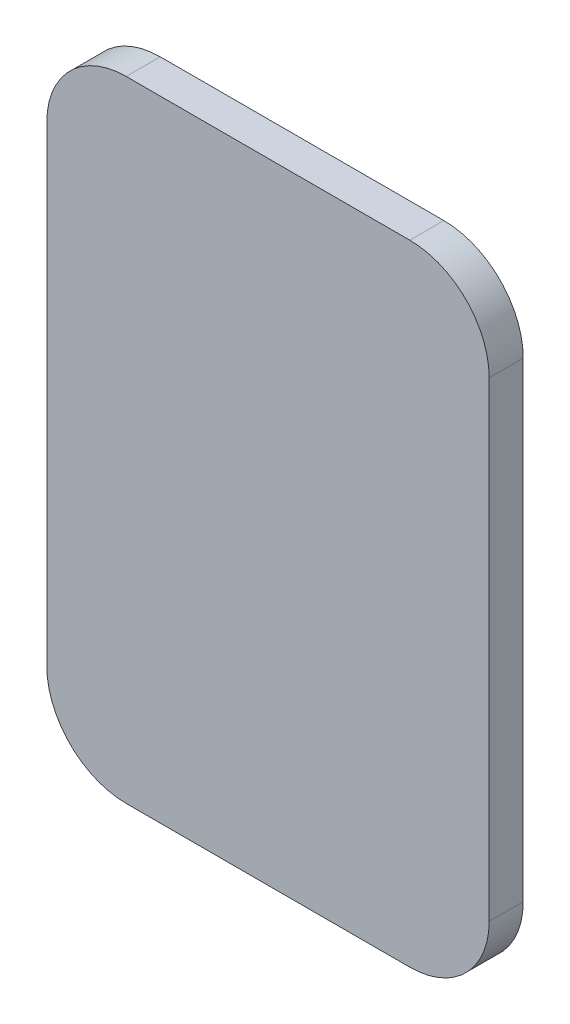
ISO-10303-21;
HEADER;
FILE_DESCRIPTION(('STEP AP214'),'2;1');
FILE_NAME('part.step','',(''),(''),'','','');
FILE_SCHEMA(('AUTOMOTIVE_DESIGN { 1 0 10303 214 1 1 1 1 }'));
ENDSEC;
DATA;
#1=APPLICATION_CONTEXT('core data for automotive mechanical design processes');
#2=APPLICATION_PROTOCOL_DEFINITION('international standard','automotive_design',2000,#1);
#3=PRODUCT_CONTEXT('',#1,'mechanical');
#4=PRODUCT('Part','Part','',(#3));
#5=PRODUCT_RELATED_PRODUCT_CATEGORY('part','',(#4));
#6=PRODUCT_DEFINITION_FORMATION('','',#4);
#7=PRODUCT_DEFINITION_CONTEXT('part definition',#1,'design');
#8=PRODUCT_DEFINITION('design','',#6,#7);
#9=PRODUCT_DEFINITION_SHAPE('','',#8);
#10=(LENGTH_UNIT() NAMED_UNIT(*) SI_UNIT(.MILLI.,.METRE.));
#11=(NAMED_UNIT(*) PLANE_ANGLE_UNIT() SI_UNIT($,.RADIAN.));
#12=(NAMED_UNIT(*) SI_UNIT($,.STERADIAN.) SOLID_ANGLE_UNIT());
#13=UNCERTAINTY_MEASURE_WITH_UNIT(LENGTH_MEASURE(1.E-05),#10,'distance_accuracy_value','');
#14=(GEOMETRIC_REPRESENTATION_CONTEXT(3) GLOBAL_UNCERTAINTY_ASSIGNED_CONTEXT((#13)) GLOBAL_UNIT_ASSIGNED_CONTEXT((#10,
#11,#12)) REPRESENTATION_CONTEXT('',''));
#15=CARTESIAN_POINT('',(0.,0.,0.));
#16=DIRECTION('',(0.,0.,1.));
#17=DIRECTION('',(1.,0.,0.));
#18=AXIS2_PLACEMENT_3D('',#15,#16,#17);
#19=CARTESIAN_POINT('',(-25.,41.5,6.));
#20=DIRECTION('',(0.,0.,-1.));
#21=DIRECTION('',(-1.,0.,0.));
#22=AXIS2_PLACEMENT_3D('',#19,#20,#21);
#23=CYLINDRICAL_SURFACE('',#22,14.);
#24=CARTESIAN_POINT('',(-25.,41.5,0.));
#25=DIRECTION('',(0.,0.,1.));
#26=DIRECTION('',(-1.,0.,0.));
#27=AXIS2_PLACEMENT_3D('',#24,#25,#26);
#28=CIRCLE('',#27,14.);
#29=CARTESIAN_POINT('',(-25.,55.5,0.));
#30=VERTEX_POINT('',#29);
#31=CARTESIAN_POINT('',(-39.,41.5,0.));
#32=VERTEX_POINT('',#31);
#33=EDGE_CURVE('E131',#30,#32,#28,.T.);
#34=ORIENTED_EDGE('',*,*,#33,.T.);
#35=DIRECTION('',(0.,0.,-1.));
#36=VECTOR('',#35,1.);
#37=CARTESIAN_POINT('',(-39.,41.5,6.));
#38=LINE('',#37,#36);
#39=CARTESIAN_POINT('',(-39.,41.5,6.));
#40=VERTEX_POINT('',#39);
#41=EDGE_CURVE('E11',#40,#32,#38,.T.);
#42=ORIENTED_EDGE('',*,*,#41,.F.);
#43=CARTESIAN_POINT('',(-25.,41.5,6.));
#44=DIRECTION('',(0.,0.,1.));
#45=DIRECTION('',(-1.,0.,0.));
#46=AXIS2_PLACEMENT_3D('',#43,#44,#45);
#47=CIRCLE('',#46,14.);
#48=CARTESIAN_POINT('',(-25.,55.5,6.));
#49=VERTEX_POINT('',#48);
#50=EDGE_CURVE('E145',#49,#40,#47,.T.);
#51=ORIENTED_EDGE('',*,*,#50,.F.);
#52=DIRECTION('',(0.,0.,-1.));
#53=VECTOR('',#52,1.);
#54=CARTESIAN_POINT('',(-25.,55.5,6.));
#55=LINE('',#54,#53);
#56=EDGE_CURVE('E127',#49,#30,#55,.T.);
#57=ORIENTED_EDGE('',*,*,#56,.T.);
#58=EDGE_LOOP('',(#34,#42,#51,#57));
#59=FACE_BOUND('',#58,.T.);
#60=ADVANCED_FACE('F35',(#59),#23,.T.);
#61=CARTESIAN_POINT('',(-39.,-41.5,6.));
#62=DIRECTION('',(1.,0.,0.));
#63=DIRECTION('',(0.,0.,-1.));
#64=AXIS2_PLACEMENT_3D('',#61,#62,#63);
#65=PLANE('',#64);
#66=DIRECTION('',(0.,-1.,0.));
#67=VECTOR('',#66,1.);
#68=CARTESIAN_POINT('',(-39.,-41.5,0.));
#69=LINE('',#68,#67);
#70=CARTESIAN_POINT('',(-39.,-41.5,0.));
#71=VERTEX_POINT('',#70);
#72=EDGE_CURVE('E134',#32,#71,#69,.T.);
#73=ORIENTED_EDGE('',*,*,#72,.T.);
#74=DIRECTION('',(0.,0.,-1.));
#75=VECTOR('',#74,1.);
#76=CARTESIAN_POINT('',(-39.,-41.5,6.));
#77=LINE('',#76,#75);
#78=CARTESIAN_POINT('',(-39.,-41.5,6.));
#79=VERTEX_POINT('',#78);
#80=EDGE_CURVE('E43',#79,#71,#77,.T.);
#81=ORIENTED_EDGE('',*,*,#80,.F.);
#82=DIRECTION('',(0.,-1.,0.));
#83=VECTOR('',#82,1.);
#84=CARTESIAN_POINT('',(-39.,-41.5,6.));
#85=LINE('',#84,#83);
#86=EDGE_CURVE('E94',#40,#79,#85,.T.);
#87=ORIENTED_EDGE('',*,*,#86,.F.);
#88=ORIENTED_EDGE('',*,*,#41,.T.);
#89=EDGE_LOOP('',(#73,#81,#87,#88));
#90=FACE_BOUND('',#89,.T.);
#91=ADVANCED_FACE('F180',(#90),#65,.F.);
#92=CARTESIAN_POINT('',(-25.,-41.5,6.));
#93=DIRECTION('',(0.,0.,-1.));
#94=DIRECTION('',(-1.,0.,0.));
#95=AXIS2_PLACEMENT_3D('',#92,#93,#94);
#96=CYLINDRICAL_SURFACE('',#95,14.);
#97=CARTESIAN_POINT('',(-25.,-41.5,0.));
#98=DIRECTION('',(0.,0.,1.));
#99=DIRECTION('',(-1.,0.,0.));
#100=AXIS2_PLACEMENT_3D('',#97,#98,#99);
#101=CIRCLE('',#100,14.);
#102=CARTESIAN_POINT('',(-25.,-55.5,0.));
#103=VERTEX_POINT('',#102);
#104=EDGE_CURVE('E136',#71,#103,#101,.T.);
#105=ORIENTED_EDGE('',*,*,#104,.T.);
#106=DIRECTION('',(0.,0.,-1.));
#107=VECTOR('',#106,1.);
#108=CARTESIAN_POINT('',(-25.,-55.5,6.));
#109=LINE('',#108,#107);
#110=CARTESIAN_POINT('',(-25.,-55.5,6.));
#111=VERTEX_POINT('',#110);
#112=EDGE_CURVE('E152',#111,#103,#109,.T.);
#113=ORIENTED_EDGE('',*,*,#112,.F.);
#114=CARTESIAN_POINT('',(-25.,-41.5,6.));
#115=DIRECTION('',(0.,0.,1.));
#116=DIRECTION('',(-1.,0.,0.));
#117=AXIS2_PLACEMENT_3D('',#114,#115,#116);
#118=CIRCLE('',#117,14.);
#119=EDGE_CURVE('E160',#79,#111,#118,.T.);
#120=ORIENTED_EDGE('',*,*,#119,.F.);
#121=ORIENTED_EDGE('',*,*,#80,.T.);
#122=EDGE_LOOP('',(#105,#113,#120,#121));
#123=FACE_BOUND('',#122,.T.);
#124=ADVANCED_FACE('F158',(#123),#96,.T.);
#125=CARTESIAN_POINT('',(25.,-55.5,6.));
#126=DIRECTION('',(0.,1.,0.));
#127=DIRECTION('',(0.,0.,1.));
#128=AXIS2_PLACEMENT_3D('',#125,#126,#127);
#129=PLANE('',#128);
#130=DIRECTION('',(1.,0.,0.));
#131=VECTOR('',#130,1.);
#132=CARTESIAN_POINT('',(25.,-55.5,0.));
#133=LINE('',#132,#131);
#134=CARTESIAN_POINT('',(25.,-55.5,0.));
#135=VERTEX_POINT('',#134);
#136=EDGE_CURVE('E138',#103,#135,#133,.T.);
#137=ORIENTED_EDGE('',*,*,#136,.T.);
#138=DIRECTION('',(0.,0.,-1.));
#139=VECTOR('',#138,1.);
#140=CARTESIAN_POINT('',(25.,-55.5,6.));
#141=LINE('',#140,#139);
#142=CARTESIAN_POINT('',(25.,-55.5,6.));
#143=VERTEX_POINT('',#142);
#144=EDGE_CURVE('E149',#143,#135,#141,.T.);
#145=ORIENTED_EDGE('',*,*,#144,.F.);
#146=DIRECTION('',(1.,0.,0.));
#147=VECTOR('',#146,1.);
#148=CARTESIAN_POINT('',(25.,-55.5,6.));
#149=LINE('',#148,#147);
#150=EDGE_CURVE('E172',#111,#143,#149,.T.);
#151=ORIENTED_EDGE('',*,*,#150,.F.);
#152=ORIENTED_EDGE('',*,*,#112,.T.);
#153=EDGE_LOOP('',(#137,#145,#151,#152));
#154=FACE_BOUND('',#153,.T.);
#155=ADVANCED_FACE('F168',(#154),#129,.F.);
#156=CARTESIAN_POINT('',(24.9999999999999,-41.5,6.));
#157=DIRECTION('',(0.,0.,-1.));
#158=DIRECTION('',(-1.,0.,0.));
#159=AXIS2_PLACEMENT_3D('',#156,#157,#158);
#160=CYLINDRICAL_SURFACE('',#159,14.);
#161=CARTESIAN_POINT('',(24.9999999999999,-41.5,0.));
#162=DIRECTION('',(0.,0.,1.));
#163=DIRECTION('',(-1.,0.,0.));
#164=AXIS2_PLACEMENT_3D('',#161,#162,#163);
#165=CIRCLE('',#164,14.);
#166=CARTESIAN_POINT('',(39.,-41.5,0.));
#167=VERTEX_POINT('',#166);
#168=EDGE_CURVE('E140',#135,#167,#165,.T.);
#169=ORIENTED_EDGE('',*,*,#168,.T.);
#170=DIRECTION('',(0.,0.,-1.));
#171=VECTOR('',#170,1.);
#172=CARTESIAN_POINT('',(39.,-41.5,6.));
#173=LINE('',#172,#171);
#174=CARTESIAN_POINT('',(39.,-41.5,6.));
#175=VERTEX_POINT('',#174);
#176=EDGE_CURVE('E122',#175,#167,#173,.T.);
#177=ORIENTED_EDGE('',*,*,#176,.F.);
#178=CARTESIAN_POINT('',(24.9999999999999,-41.5,6.));
#179=DIRECTION('',(0.,0.,1.));
#180=DIRECTION('',(-1.,0.,0.));
#181=AXIS2_PLACEMENT_3D('',#178,#179,#180);
#182=CIRCLE('',#181,14.);
#183=EDGE_CURVE('E113',#143,#175,#182,.T.);
#184=ORIENTED_EDGE('',*,*,#183,.F.);
#185=ORIENTED_EDGE('',*,*,#144,.T.);
#186=EDGE_LOOP('',(#169,#177,#184,#185));
#187=FACE_BOUND('',#186,.T.);
#188=ADVANCED_FACE('F171',(#187),#160,.T.);
#189=CARTESIAN_POINT('',(39.,41.5,6.));
#190=DIRECTION('',(-1.,0.,0.));
#191=DIRECTION('',(0.,0.,1.));
#192=AXIS2_PLACEMENT_3D('',#189,#190,#191);
#193=PLANE('',#192);
#194=DIRECTION('',(0.,1.,0.));
#195=VECTOR('',#194,1.);
#196=CARTESIAN_POINT('',(39.,41.5,0.));
#197=LINE('',#196,#195);
#198=CARTESIAN_POINT('',(39.,41.5,0.));
#199=VERTEX_POINT('',#198);
#200=EDGE_CURVE('E121',#167,#199,#197,.T.);
#201=ORIENTED_EDGE('',*,*,#200,.T.);
#202=DIRECTION('',(0.,0.,-1.));
#203=VECTOR('',#202,1.);
#204=CARTESIAN_POINT('',(39.,41.5,6.));
#205=LINE('',#204,#203);
#206=CARTESIAN_POINT('',(39.,41.5,6.));
#207=VERTEX_POINT('',#206);
#208=EDGE_CURVE('E118',#207,#199,#205,.T.);
#209=ORIENTED_EDGE('',*,*,#208,.F.);
#210=DIRECTION('',(0.,1.,0.));
#211=VECTOR('',#210,1.);
#212=CARTESIAN_POINT('',(39.,41.5,6.));
#213=LINE('',#212,#211);
#214=EDGE_CURVE('E107',#175,#207,#213,.T.);
#215=ORIENTED_EDGE('',*,*,#214,.F.);
#216=ORIENTED_EDGE('',*,*,#176,.T.);
#217=EDGE_LOOP('',(#201,#209,#215,#216));
#218=FACE_BOUND('',#217,.T.);
#219=ADVANCED_FACE('F119',(#218),#193,.F.);
#220=CARTESIAN_POINT('',(25.,41.5,6.));
#221=DIRECTION('',(0.,0.,-1.));
#222=DIRECTION('',(-1.,0.,0.));
#223=AXIS2_PLACEMENT_3D('',#220,#221,#222);
#224=CYLINDRICAL_SURFACE('',#223,14.);
#225=CARTESIAN_POINT('',(25.,41.5,0.));
#226=DIRECTION('',(0.,0.,1.));
#227=DIRECTION('',(-1.,0.,0.));
#228=AXIS2_PLACEMENT_3D('',#225,#226,#227);
#229=CIRCLE('',#228,14.);
#230=CARTESIAN_POINT('',(25.,55.5,0.));
#231=VERTEX_POINT('',#230);
#232=EDGE_CURVE('E80',#199,#231,#229,.T.);
#233=ORIENTED_EDGE('',*,*,#232,.T.);
#234=DIRECTION('',(0.,0.,-1.));
#235=VECTOR('',#234,1.);
#236=CARTESIAN_POINT('',(25.,55.5,6.));
#237=LINE('',#236,#235);
#238=CARTESIAN_POINT('',(25.,55.5,6.));
#239=VERTEX_POINT('',#238);
#240=EDGE_CURVE('E123',#239,#231,#237,.T.);
#241=ORIENTED_EDGE('',*,*,#240,.F.);
#242=CARTESIAN_POINT('',(25.,41.5,6.));
#243=DIRECTION('',(0.,0.,1.));
#244=DIRECTION('',(-1.,0.,0.));
#245=AXIS2_PLACEMENT_3D('',#242,#243,#244);
#246=CIRCLE('',#245,14.);
#247=EDGE_CURVE('E111',#207,#239,#246,.T.);
#248=ORIENTED_EDGE('',*,*,#247,.F.);
#249=ORIENTED_EDGE('',*,*,#208,.T.);
#250=EDGE_LOOP('',(#233,#241,#248,#249));
#251=FACE_BOUND('',#250,.T.);
#252=ADVANCED_FACE('F125',(#251),#224,.T.);
#253=CARTESIAN_POINT('',(-25.,55.5,6.));
#254=DIRECTION('',(0.,-1.,0.));
#255=DIRECTION('',(0.,0.,-1.));
#256=AXIS2_PLACEMENT_3D('',#253,#254,#255);
#257=PLANE('',#256);
#258=DIRECTION('',(-1.,0.,0.));
#259=VECTOR('',#258,1.);
#260=CARTESIAN_POINT('',(-25.,55.5,0.));
#261=LINE('',#260,#259);
#262=EDGE_CURVE('E86',#231,#30,#261,.T.);
#263=ORIENTED_EDGE('',*,*,#262,.T.);
#264=ORIENTED_EDGE('',*,*,#56,.F.);
#265=DIRECTION('',(-1.,0.,0.));
#266=VECTOR('',#265,1.);
#267=CARTESIAN_POINT('',(-25.,55.5,6.));
#268=LINE('',#267,#266);
#269=EDGE_CURVE('E51',#239,#49,#268,.T.);
#270=ORIENTED_EDGE('',*,*,#269,.F.);
#271=ORIENTED_EDGE('',*,*,#240,.T.);
#272=EDGE_LOOP('',(#263,#264,#270,#271));
#273=FACE_BOUND('',#272,.T.);
#274=ADVANCED_FACE('F196',(#273),#257,.F.);
#275=CARTESIAN_POINT('',(-25.,41.5,6.));
#276=DIRECTION('',(0.,0.,-1.));
#277=DIRECTION('',(-1.,0.,0.));
#278=AXIS2_PLACEMENT_3D('',#275,#276,#277);
#279=PLANE('',#278);
#280=ORIENTED_EDGE('',*,*,#50,.T.);
#281=ORIENTED_EDGE('',*,*,#86,.T.);
#282=ORIENTED_EDGE('',*,*,#119,.T.);
#283=ORIENTED_EDGE('',*,*,#150,.T.);
#284=ORIENTED_EDGE('',*,*,#183,.T.);
#285=ORIENTED_EDGE('',*,*,#214,.T.);
#286=ORIENTED_EDGE('',*,*,#247,.T.);
#287=ORIENTED_EDGE('',*,*,#269,.T.);
#288=EDGE_LOOP('',(#280,#281,#282,#283,#284,#285,#286,#287));
#289=FACE_BOUND('',#288,.T.);
#290=ADVANCED_FACE('F109',(#289),#279,.F.);
#291=CARTESIAN_POINT('',(-25.,41.5,0.));
#292=DIRECTION('',(0.,0.,-1.));
#293=DIRECTION('',(-1.,0.,0.));
#294=AXIS2_PLACEMENT_3D('',#291,#292,#293);
#295=PLANE('',#294);
#296=ORIENTED_EDGE('',*,*,#33,.F.);
#297=ORIENTED_EDGE('',*,*,#262,.F.);
#298=ORIENTED_EDGE('',*,*,#232,.F.);
#299=ORIENTED_EDGE('',*,*,#200,.F.);
#300=ORIENTED_EDGE('',*,*,#168,.F.);
#301=ORIENTED_EDGE('',*,*,#136,.F.);
#302=ORIENTED_EDGE('',*,*,#104,.F.);
#303=ORIENTED_EDGE('',*,*,#72,.F.);
#304=EDGE_LOOP('',(#296,#297,#298,#299,#300,#301,#302,#303));
#305=FACE_BOUND('',#304,.T.);
#306=ADVANCED_FACE('F164',(#305),#295,.T.);
#307=CLOSED_SHELL('',(#60,#91,#124,#155,#188,#219,#252,#274,#290,#306));
#308=MANIFOLD_SOLID_BREP('B2',#307);
#309=ADVANCED_BREP_SHAPE_REPRESENTATION('',(#18,#308),#14);
#310=SHAPE_DEFINITION_REPRESENTATION(#9,#309);
ENDSEC;
END-ISO-10303-21;
